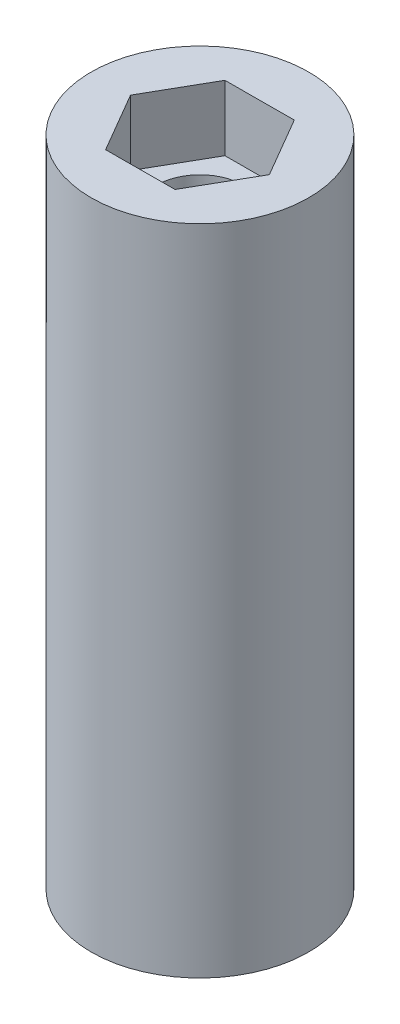
ISO-10303-21;
HEADER;
FILE_DESCRIPTION(('STEP AP214'),'2;1');
FILE_NAME('part.step','',(''),(''),'','','');
FILE_SCHEMA(('AUTOMOTIVE_DESIGN { 1 0 10303 214 1 1 1 1 }'));
ENDSEC;
DATA;
#1=APPLICATION_CONTEXT('core data for automotive mechanical design processes');
#2=APPLICATION_PROTOCOL_DEFINITION('international standard','automotive_design',2000,#1);
#3=PRODUCT_CONTEXT('',#1,'mechanical');
#4=PRODUCT('Part','Part','',(#3));
#5=PRODUCT_RELATED_PRODUCT_CATEGORY('part','',(#4));
#6=PRODUCT_DEFINITION_FORMATION('','',#4);
#7=PRODUCT_DEFINITION_CONTEXT('part definition',#1,'design');
#8=PRODUCT_DEFINITION('design','',#6,#7);
#9=PRODUCT_DEFINITION_SHAPE('','',#8);
#10=(LENGTH_UNIT() NAMED_UNIT(*) SI_UNIT(.MILLI.,.METRE.));
#11=(NAMED_UNIT(*) PLANE_ANGLE_UNIT() SI_UNIT($,.RADIAN.));
#12=(NAMED_UNIT(*) SI_UNIT($,.STERADIAN.) SOLID_ANGLE_UNIT());
#13=UNCERTAINTY_MEASURE_WITH_UNIT(LENGTH_MEASURE(1.E-05),#10,'distance_accuracy_value','');
#14=(GEOMETRIC_REPRESENTATION_CONTEXT(3) GLOBAL_UNCERTAINTY_ASSIGNED_CONTEXT((#13)) GLOBAL_UNIT_ASSIGNED_CONTEXT((#10,
#11,#12)) REPRESENTATION_CONTEXT('',''));
#15=CARTESIAN_POINT('',(0.,0.,0.));
#16=DIRECTION('',(0.,0.,1.));
#17=DIRECTION('',(1.,0.,0.));
#18=AXIS2_PLACEMENT_3D('',#15,#16,#17);
#19=CARTESIAN_POINT('',(0.,0.,0.));
#20=DIRECTION('',(0.,1.,0.));
#21=DIRECTION('',(0.,0.,1.));
#22=AXIS2_PLACEMENT_3D('',#19,#20,#21);
#23=CYLINDRICAL_SURFACE('',#22,2.);
#24=CARTESIAN_POINT('',(0.,3.,0.));
#25=DIRECTION('',(0.,1.,0.));
#26=DIRECTION('',(0.,0.,1.));
#27=AXIS2_PLACEMENT_3D('',#24,#25,#26);
#28=CIRCLE('',#27,2.);
#29=CARTESIAN_POINT('',(0.,3.,2.));
#30=VERTEX_POINT('',#29);
#31=EDGE_CURVE('E37',#30,#30,#28,.F.);
#32=ORIENTED_EDGE('',*,*,#31,.T.);
#33=EDGE_LOOP('',(#32));
#34=FACE_BOUND('',#33,.T.);
#35=CARTESIAN_POINT('',(0.,27.,0.));
#36=DIRECTION('',(0.,1.,0.));
#37=DIRECTION('',(0.,0.,1.));
#38=AXIS2_PLACEMENT_3D('',#35,#36,#37);
#39=CIRCLE('',#38,2.);
#40=CARTESIAN_POINT('',(0.,27.,2.));
#41=VERTEX_POINT('',#40);
#42=EDGE_CURVE('E217',#41,#41,#39,.F.);
#43=ORIENTED_EDGE('',*,*,#42,.F.);
#44=EDGE_LOOP('',(#43));
#45=FACE_BOUND('',#44,.T.);
#46=ADVANCED_FACE('F33',(#34,#45),#23,.F.);
#47=CARTESIAN_POINT('',(0.,30.,0.));
#48=DIRECTION('',(0.,-1.,0.));
#49=DIRECTION('',(0.,0.,-1.));
#50=AXIS2_PLACEMENT_3D('',#47,#48,#49);
#51=CYLINDRICAL_SURFACE('',#50,5.);
#52=CARTESIAN_POINT('',(0.,30.,0.));
#53=DIRECTION('',(0.,1.,0.));
#54=DIRECTION('',(0.,0.,1.));
#55=AXIS2_PLACEMENT_3D('',#52,#53,#54);
#56=CIRCLE('',#55,5.);
#57=CARTESIAN_POINT('',(0.,30.,5.));
#58=VERTEX_POINT('',#57);
#59=EDGE_CURVE('E11',#58,#58,#56,.T.);
#60=ORIENTED_EDGE('',*,*,#59,.F.);
#61=EDGE_LOOP('',(#60));
#62=FACE_BOUND('',#61,.T.);
#63=CARTESIAN_POINT('',(0.,0.,0.));
#64=DIRECTION('',(0.,1.,0.));
#65=DIRECTION('',(0.,0.,1.));
#66=AXIS2_PLACEMENT_3D('',#63,#64,#65);
#67=CIRCLE('',#66,5.);
#68=CARTESIAN_POINT('',(0.,0.,5.));
#69=VERTEX_POINT('',#68);
#70=EDGE_CURVE('E42',#69,#69,#67,.T.);
#71=ORIENTED_EDGE('',*,*,#70,.T.);
#72=EDGE_LOOP('',(#71));
#73=FACE_BOUND('',#72,.T.);
#74=ADVANCED_FACE('F35',(#62,#73),#51,.T.);
#75=CARTESIAN_POINT('',(0.,30.,0.));
#76=DIRECTION('',(0.,1.,0.));
#77=DIRECTION('',(0.,0.,1.));
#78=AXIS2_PLACEMENT_3D('',#75,#76,#77);
#79=PLANE('',#78);
#80=DIRECTION('',(0.99999151154788,0.,-0.00412029515770227));
#81=VECTOR('',#80,1.);
#82=CARTESIAN_POINT('',(-1.57636895135997,30.,2.75651850393238));
#83=LINE('',#82,#81);
#84=CARTESIAN_POINT('',(-1.57636895135997,30.,2.75651850393238));
#85=VERTEX_POINT('',#84);
#86=CARTESIAN_POINT('',(1.59903057472733,30.,2.74343480958096));
#87=VERTEX_POINT('',#86);
#88=EDGE_CURVE('E58',#85,#87,#83,.T.);
#89=ORIENTED_EDGE('',*,*,#88,.F.);
#90=DIRECTION('',(0.5035640360516,0.,0.863957904990413));
#91=VECTOR('',#90,1.);
#92=CARTESIAN_POINT('',(-3.1753995260873,30.,0.0130836943514207));
#93=LINE('',#92,#91);
#94=CARTESIAN_POINT('',(-3.1753995260873,30.,0.0130836943514207));
#95=VERTEX_POINT('',#94);
#96=EDGE_CURVE('E184',#95,#85,#93,.T.);
#97=ORIENTED_EDGE('',*,*,#96,.F.);
#98=DIRECTION('',(-0.496427475496279,0.,0.868078200148115));
#99=VECTOR('',#98,1.);
#100=CARTESIAN_POINT('',(-1.59903057472733,30.,-2.74343480958096));
#101=LINE('',#100,#99);
#102=CARTESIAN_POINT('',(-1.59903057472733,30.,-2.74343480958096));
#103=VERTEX_POINT('',#102);
#104=EDGE_CURVE('E210',#103,#95,#101,.T.);
#105=ORIENTED_EDGE('',*,*,#104,.F.);
#106=DIRECTION('',(-0.99999151154788,0.,0.00412029515770227));
#107=VECTOR('',#106,1.);
#108=CARTESIAN_POINT('',(1.57636895135997,30.,-2.75651850393238));
#109=LINE('',#108,#107);
#110=CARTESIAN_POINT('',(1.57636895135997,30.,-2.75651850393238));
#111=VERTEX_POINT('',#110);
#112=EDGE_CURVE('E207',#111,#103,#109,.T.);
#113=ORIENTED_EDGE('',*,*,#112,.F.);
#114=DIRECTION('',(-0.5035640360516,0.,-0.863957904990413));
#115=VECTOR('',#114,1.);
#116=CARTESIAN_POINT('',(3.1753995260873,30.,-0.0130836943514213));
#117=LINE('',#116,#115);
#118=CARTESIAN_POINT('',(3.1753995260873,30.,-0.0130836943514213));
#119=VERTEX_POINT('',#118);
#120=EDGE_CURVE('E204',#119,#111,#117,.T.);
#121=ORIENTED_EDGE('',*,*,#120,.F.);
#122=DIRECTION('',(0.496427475496279,0.,-0.868078200148115));
#123=VECTOR('',#122,1.);
#124=CARTESIAN_POINT('',(1.59903057472733,30.,2.74343480958096));
#125=LINE('',#124,#123);
#126=EDGE_CURVE('E201',#87,#119,#125,.T.);
#127=ORIENTED_EDGE('',*,*,#126,.F.);
#128=EDGE_LOOP('',(#89,#97,#105,#113,#121,#127));
#129=FACE_BOUND('',#128,.T.);
#130=ORIENTED_EDGE('',*,*,#59,.T.);
#131=EDGE_LOOP('',(#130));
#132=FACE_BOUND('',#131,.T.);
#133=ADVANCED_FACE('F239',(#129,#132),#79,.T.);
#134=CARTESIAN_POINT('',(0.,0.,0.));
#135=DIRECTION('',(0.,1.,0.));
#136=DIRECTION('',(0.,0.,1.));
#137=AXIS2_PLACEMENT_3D('',#134,#135,#136);
#138=PLANE('',#137);
#139=DIRECTION('',(0.5035640360516,0.,0.863957904990413));
#140=VECTOR('',#139,1.);
#141=CARTESIAN_POINT('',(-3.1753995260873,0.,0.0130836943514207));
#142=LINE('',#141,#140);
#143=CARTESIAN_POINT('',(-3.1753995260873,0.,0.0130836943514207));
#144=VERTEX_POINT('',#143);
#145=CARTESIAN_POINT('',(-1.57636895135997,0.,2.75651850393238));
#146=VERTEX_POINT('',#145);
#147=EDGE_CURVE('E136',#144,#146,#142,.T.);
#148=ORIENTED_EDGE('',*,*,#147,.T.);
#149=DIRECTION('',(0.99999151154788,0.,-0.00412029515770227));
#150=VECTOR('',#149,1.);
#151=CARTESIAN_POINT('',(-1.57636895135997,0.,2.75651850393238));
#152=LINE('',#151,#150);
#153=CARTESIAN_POINT('',(1.59903057472733,0.,2.74343480958096));
#154=VERTEX_POINT('',#153);
#155=EDGE_CURVE('E128',#146,#154,#152,.T.);
#156=ORIENTED_EDGE('',*,*,#155,.T.);
#157=DIRECTION('',(0.496427475496279,0.,-0.868078200148115));
#158=VECTOR('',#157,1.);
#159=CARTESIAN_POINT('',(1.59903057472733,0.,2.74343480958096));
#160=LINE('',#159,#158);
#161=CARTESIAN_POINT('',(3.1753995260873,0.,-0.0130836943514213));
#162=VERTEX_POINT('',#161);
#163=EDGE_CURVE('E139',#154,#162,#160,.T.);
#164=ORIENTED_EDGE('',*,*,#163,.T.);
#165=DIRECTION('',(-0.5035640360516,0.,-0.863957904990413));
#166=VECTOR('',#165,1.);
#167=CARTESIAN_POINT('',(3.1753995260873,0.,-0.0130836943514213));
#168=LINE('',#167,#166);
#169=CARTESIAN_POINT('',(1.57636895135997,0.,-2.75651850393238));
#170=VERTEX_POINT('',#169);
#171=EDGE_CURVE('E50',#162,#170,#168,.T.);
#172=ORIENTED_EDGE('',*,*,#171,.T.);
#173=DIRECTION('',(-0.99999151154788,0.,0.00412029515770227));
#174=VECTOR('',#173,1.);
#175=CARTESIAN_POINT('',(1.57636895135997,0.,-2.75651850393238));
#176=LINE('',#175,#174);
#177=CARTESIAN_POINT('',(-1.59903057472733,0.,-2.74343480958096));
#178=VERTEX_POINT('',#177);
#179=EDGE_CURVE('E154',#170,#178,#176,.T.);
#180=ORIENTED_EDGE('',*,*,#179,.T.);
#181=DIRECTION('',(-0.496427475496279,0.,0.868078200148115));
#182=VECTOR('',#181,1.);
#183=CARTESIAN_POINT('',(-1.59903057472733,0.,-2.74343480958096));
#184=LINE('',#183,#182);
#185=EDGE_CURVE('E157',#178,#144,#184,.T.);
#186=ORIENTED_EDGE('',*,*,#185,.T.);
#187=EDGE_LOOP('',(#148,#156,#164,#172,#180,#186));
#188=FACE_BOUND('',#187,.T.);
#189=ORIENTED_EDGE('',*,*,#70,.F.);
#190=EDGE_LOOP('',(#189));
#191=FACE_BOUND('',#190,.T.);
#192=ADVANCED_FACE('F143',(#188,#191),#138,.F.);
#193=CARTESIAN_POINT('',(0.,27.,0.));
#194=DIRECTION('',(0.,1.,0.));
#195=DIRECTION('',(0.,0.,1.));
#196=AXIS2_PLACEMENT_3D('',#193,#194,#195);
#197=PLANE('',#196);
#198=DIRECTION('',(0.99999151154788,0.,-0.00412029515770227));
#199=VECTOR('',#198,1.);
#200=CARTESIAN_POINT('',(-1.57636895135997,27.,2.75651850393238));
#201=LINE('',#200,#199);
#202=CARTESIAN_POINT('',(-1.57636895135997,27.,2.75651850393238));
#203=VERTEX_POINT('',#202);
#204=CARTESIAN_POINT('',(1.59903057472733,27.,2.74343480958096));
#205=VERTEX_POINT('',#204);
#206=EDGE_CURVE('E180',#203,#205,#201,.T.);
#207=ORIENTED_EDGE('',*,*,#206,.T.);
#208=DIRECTION('',(0.496427475496279,0.,-0.868078200148115));
#209=VECTOR('',#208,1.);
#210=CARTESIAN_POINT('',(1.59903057472733,27.,2.74343480958096));
#211=LINE('',#210,#209);
#212=CARTESIAN_POINT('',(3.1753995260873,27.,-0.0130836943514213));
#213=VERTEX_POINT('',#212);
#214=EDGE_CURVE('E183',#205,#213,#211,.T.);
#215=ORIENTED_EDGE('',*,*,#214,.T.);
#216=DIRECTION('',(-0.5035640360516,0.,-0.863957904990413));
#217=VECTOR('',#216,1.);
#218=CARTESIAN_POINT('',(3.1753995260873,27.,-0.0130836943514213));
#219=LINE('',#218,#217);
#220=CARTESIAN_POINT('',(1.57636895135997,27.,-2.75651850393238));
#221=VERTEX_POINT('',#220);
#222=EDGE_CURVE('E187',#213,#221,#219,.T.);
#223=ORIENTED_EDGE('',*,*,#222,.T.);
#224=DIRECTION('',(-0.99999151154788,0.,0.00412029515770227));
#225=VECTOR('',#224,1.);
#226=CARTESIAN_POINT('',(1.57636895135997,27.,-2.75651850393238));
#227=LINE('',#226,#225);
#228=CARTESIAN_POINT('',(-1.59903057472733,27.,-2.74343480958096));
#229=VERTEX_POINT('',#228);
#230=EDGE_CURVE('E190',#221,#229,#227,.T.);
#231=ORIENTED_EDGE('',*,*,#230,.T.);
#232=DIRECTION('',(-0.496427475496279,0.,0.868078200148115));
#233=VECTOR('',#232,1.);
#234=CARTESIAN_POINT('',(-1.59903057472733,27.,-2.74343480958096));
#235=LINE('',#234,#233);
#236=CARTESIAN_POINT('',(-3.1753995260873,27.,0.0130836943514207));
#237=VERTEX_POINT('',#236);
#238=EDGE_CURVE('E193',#229,#237,#235,.T.);
#239=ORIENTED_EDGE('',*,*,#238,.T.);
#240=DIRECTION('',(0.5035640360516,0.,0.863957904990413));
#241=VECTOR('',#240,1.);
#242=CARTESIAN_POINT('',(-3.1753995260873,27.,0.0130836943514207));
#243=LINE('',#242,#241);
#244=EDGE_CURVE('E196',#237,#203,#243,.T.);
#245=ORIENTED_EDGE('',*,*,#244,.T.);
#246=EDGE_LOOP('',(#207,#215,#223,#231,#239,#245));
#247=FACE_BOUND('',#246,.T.);
#248=ORIENTED_EDGE('',*,*,#42,.T.);
#249=EDGE_LOOP('',(#248));
#250=FACE_BOUND('',#249,.T.);
#251=ADVANCED_FACE('F231',(#247,#250),#197,.T.);
#252=CARTESIAN_POINT('',(-1.57636895135997,27.,2.75651850393238));
#253=DIRECTION('',(0.00412029515770227,0.,0.99999151154788));
#254=DIRECTION('',(0.99999151154788,0.,-0.00412029515770227));
#255=AXIS2_PLACEMENT_3D('',#252,#253,#254);
#256=PLANE('',#255);
#257=ORIENTED_EDGE('',*,*,#88,.T.);
#258=DIRECTION('',(0.,1.,0.));
#259=VECTOR('',#258,1.);
#260=CARTESIAN_POINT('',(1.59903057472733,27.,2.74343480958096));
#261=LINE('',#260,#259);
#262=EDGE_CURVE('E199',#205,#87,#261,.T.);
#263=ORIENTED_EDGE('',*,*,#262,.F.);
#264=ORIENTED_EDGE('',*,*,#206,.F.);
#265=DIRECTION('',(0.,1.,0.));
#266=VECTOR('',#265,1.);
#267=CARTESIAN_POINT('',(-1.57636895135997,27.,2.75651850393238));
#268=LINE('',#267,#266);
#269=EDGE_CURVE('E215',#203,#85,#268,.T.);
#270=ORIENTED_EDGE('',*,*,#269,.T.);
#271=EDGE_LOOP('',(#257,#263,#264,#270));
#272=FACE_BOUND('',#271,.T.);
#273=ADVANCED_FACE('F244',(#272),#256,.F.);
#274=CARTESIAN_POINT('',(-3.1753995260873,27.,0.0130836943514207));
#275=DIRECTION('',(-0.863957904990413,0.,0.5035640360516));
#276=DIRECTION('',(0.5035640360516,0.,0.863957904990413));
#277=AXIS2_PLACEMENT_3D('',#274,#275,#276);
#278=PLANE('',#277);
#279=ORIENTED_EDGE('',*,*,#96,.T.);
#280=ORIENTED_EDGE('',*,*,#269,.F.);
#281=ORIENTED_EDGE('',*,*,#244,.F.);
#282=DIRECTION('',(0.,1.,0.));
#283=VECTOR('',#282,1.);
#284=CARTESIAN_POINT('',(-3.1753995260873,27.,0.0130836943514207));
#285=LINE('',#284,#283);
#286=EDGE_CURVE('E218',#237,#95,#285,.T.);
#287=ORIENTED_EDGE('',*,*,#286,.T.);
#288=EDGE_LOOP('',(#279,#280,#281,#287));
#289=FACE_BOUND('',#288,.T.);
#290=ADVANCED_FACE('F257',(#289),#278,.F.);
#291=CARTESIAN_POINT('',(-1.59903057472733,27.,-2.74343480958096));
#292=DIRECTION('',(-0.868078200148115,0.,-0.496427475496279));
#293=DIRECTION('',(-0.496427475496279,0.,0.868078200148115));
#294=AXIS2_PLACEMENT_3D('',#291,#292,#293);
#295=PLANE('',#294);
#296=ORIENTED_EDGE('',*,*,#104,.T.);
#297=ORIENTED_EDGE('',*,*,#286,.F.);
#298=ORIENTED_EDGE('',*,*,#238,.F.);
#299=DIRECTION('',(0.,1.,0.));
#300=VECTOR('',#299,1.);
#301=CARTESIAN_POINT('',(-1.59903057472733,27.,-2.74343480958096));
#302=LINE('',#301,#300);
#303=EDGE_CURVE('E220',#229,#103,#302,.T.);
#304=ORIENTED_EDGE('',*,*,#303,.T.);
#305=EDGE_LOOP('',(#296,#297,#298,#304));
#306=FACE_BOUND('',#305,.T.);
#307=ADVANCED_FACE('F263',(#306),#295,.F.);
#308=CARTESIAN_POINT('',(1.57636895135997,27.,-2.75651850393238));
#309=DIRECTION('',(-0.00412029515770227,0.,-0.99999151154788));
#310=DIRECTION('',(-0.99999151154788,0.,0.00412029515770227));
#311=AXIS2_PLACEMENT_3D('',#308,#309,#310);
#312=PLANE('',#311);
#313=ORIENTED_EDGE('',*,*,#112,.T.);
#314=ORIENTED_EDGE('',*,*,#303,.F.);
#315=ORIENTED_EDGE('',*,*,#230,.F.);
#316=DIRECTION('',(0.,1.,0.));
#317=VECTOR('',#316,1.);
#318=CARTESIAN_POINT('',(1.57636895135997,27.,-2.75651850393238));
#319=LINE('',#318,#317);
#320=EDGE_CURVE('E222',#221,#111,#319,.T.);
#321=ORIENTED_EDGE('',*,*,#320,.T.);
#322=EDGE_LOOP('',(#313,#314,#315,#321));
#323=FACE_BOUND('',#322,.T.);
#324=ADVANCED_FACE('F267',(#323),#312,.F.);
#325=CARTESIAN_POINT('',(3.1753995260873,27.,-0.0130836943514213));
#326=DIRECTION('',(0.863957904990413,0.,-0.5035640360516));
#327=DIRECTION('',(-0.5035640360516,0.,-0.863957904990413));
#328=AXIS2_PLACEMENT_3D('',#325,#326,#327);
#329=PLANE('',#328);
#330=ORIENTED_EDGE('',*,*,#120,.T.);
#331=ORIENTED_EDGE('',*,*,#320,.F.);
#332=ORIENTED_EDGE('',*,*,#222,.F.);
#333=DIRECTION('',(0.,1.,0.));
#334=VECTOR('',#333,1.);
#335=CARTESIAN_POINT('',(3.1753995260873,27.,-0.0130836943514213));
#336=LINE('',#335,#334);
#337=EDGE_CURVE('E224',#213,#119,#336,.T.);
#338=ORIENTED_EDGE('',*,*,#337,.T.);
#339=EDGE_LOOP('',(#330,#331,#332,#338));
#340=FACE_BOUND('',#339,.T.);
#341=ADVANCED_FACE('F271',(#340),#329,.F.);
#342=CARTESIAN_POINT('',(1.59903057472733,27.,2.74343480958096));
#343=DIRECTION('',(0.868078200148115,0.,0.496427475496279));
#344=DIRECTION('',(0.496427475496279,0.,-0.868078200148115));
#345=AXIS2_PLACEMENT_3D('',#342,#343,#344);
#346=PLANE('',#345);
#347=ORIENTED_EDGE('',*,*,#126,.T.);
#348=ORIENTED_EDGE('',*,*,#337,.F.);
#349=ORIENTED_EDGE('',*,*,#214,.F.);
#350=ORIENTED_EDGE('',*,*,#262,.T.);
#351=EDGE_LOOP('',(#347,#348,#349,#350));
#352=FACE_BOUND('',#351,.T.);
#353=ADVANCED_FACE('F274',(#352),#346,.F.);
#354=CARTESIAN_POINT('',(0.,3.,0.));
#355=DIRECTION('',(0.,1.,0.));
#356=DIRECTION('',(0.,0.,1.));
#357=AXIS2_PLACEMENT_3D('',#354,#355,#356);
#358=PLANE('',#357);
#359=DIRECTION('',(0.99999151154788,0.,-0.00412029515770227));
#360=VECTOR('',#359,1.);
#361=CARTESIAN_POINT('',(-1.57636895135997,3.,2.75651850393238));
#362=LINE('',#361,#360);
#363=CARTESIAN_POINT('',(-1.57636895135997,3.,2.75651850393238));
#364=VERTEX_POINT('',#363);
#365=CARTESIAN_POINT('',(1.59903057472733,3.,2.74343480958096));
#366=VERTEX_POINT('',#365);
#367=EDGE_CURVE('E131',#364,#366,#362,.T.);
#368=ORIENTED_EDGE('',*,*,#367,.F.);
#369=DIRECTION('',(0.5035640360516,0.,0.863957904990413));
#370=VECTOR('',#369,1.);
#371=CARTESIAN_POINT('',(-3.1753995260873,3.,0.0130836943514207));
#372=LINE('',#371,#370);
#373=CARTESIAN_POINT('',(-3.1753995260873,3.,0.0130836943514207));
#374=VERTEX_POINT('',#373);
#375=EDGE_CURVE('E147',#374,#364,#372,.T.);
#376=ORIENTED_EDGE('',*,*,#375,.F.);
#377=DIRECTION('',(-0.496427475496279,0.,0.868078200148115));
#378=VECTOR('',#377,1.);
#379=CARTESIAN_POINT('',(-1.59903057472733,3.,-2.74343480958096));
#380=LINE('',#379,#378);
#381=CARTESIAN_POINT('',(-1.59903057472733,3.,-2.74343480958096));
#382=VERTEX_POINT('',#381);
#383=EDGE_CURVE('E150',#382,#374,#380,.T.);
#384=ORIENTED_EDGE('',*,*,#383,.F.);
#385=DIRECTION('',(-0.99999151154788,0.,0.00412029515770227));
#386=VECTOR('',#385,1.);
#387=CARTESIAN_POINT('',(1.57636895135997,3.,-2.75651850393238));
#388=LINE('',#387,#386);
#389=CARTESIAN_POINT('',(1.57636895135997,3.,-2.75651850393238));
#390=VERTEX_POINT('',#389);
#391=EDGE_CURVE('E166',#390,#382,#388,.T.);
#392=ORIENTED_EDGE('',*,*,#391,.F.);
#393=DIRECTION('',(-0.5035640360516,0.,-0.863957904990413));
#394=VECTOR('',#393,1.);
#395=CARTESIAN_POINT('',(3.1753995260873,3.,-0.0130836943514213));
#396=LINE('',#395,#394);
#397=CARTESIAN_POINT('',(3.1753995260873,3.,-0.0130836943514213));
#398=VERTEX_POINT('',#397);
#399=EDGE_CURVE('E163',#398,#390,#396,.T.);
#400=ORIENTED_EDGE('',*,*,#399,.F.);
#401=DIRECTION('',(0.496427475496279,0.,-0.868078200148115));
#402=VECTOR('',#401,1.);
#403=CARTESIAN_POINT('',(1.59903057472733,3.,2.74343480958096));
#404=LINE('',#403,#402);
#405=EDGE_CURVE('E161',#366,#398,#404,.T.);
#406=ORIENTED_EDGE('',*,*,#405,.F.);
#407=EDGE_LOOP('',(#368,#376,#384,#392,#400,#406));
#408=FACE_BOUND('',#407,.T.);
#409=ORIENTED_EDGE('',*,*,#31,.F.);
#410=EDGE_LOOP('',(#409));
#411=FACE_BOUND('',#410,.T.);
#412=ADVANCED_FACE('F277',(#408,#411),#358,.F.);
#413=CARTESIAN_POINT('',(-1.57636895135997,0.,2.75651850393238));
#414=DIRECTION('',(0.00412029515770227,0.,0.99999151154788));
#415=DIRECTION('',(0.99999151154788,0.,-0.00412029515770227));
#416=AXIS2_PLACEMENT_3D('',#413,#414,#415);
#417=PLANE('',#416);
#418=ORIENTED_EDGE('',*,*,#367,.T.);
#419=DIRECTION('',(0.,1.,0.));
#420=VECTOR('',#419,1.);
#421=CARTESIAN_POINT('',(1.59903057472733,0.,2.74343480958096));
#422=LINE('',#421,#420);
#423=EDGE_CURVE('E124',#154,#366,#422,.T.);
#424=ORIENTED_EDGE('',*,*,#423,.F.);
#425=ORIENTED_EDGE('',*,*,#155,.F.);
#426=DIRECTION('',(0.,1.,0.));
#427=VECTOR('',#426,1.);
#428=CARTESIAN_POINT('',(-1.57636895135997,0.,2.75651850393238));
#429=LINE('',#428,#427);
#430=EDGE_CURVE('E171',#146,#364,#429,.T.);
#431=ORIENTED_EDGE('',*,*,#430,.T.);
#432=EDGE_LOOP('',(#418,#424,#425,#431));
#433=FACE_BOUND('',#432,.T.);
#434=ADVANCED_FACE('F126',(#433),#417,.F.);
#435=CARTESIAN_POINT('',(-3.1753995260873,0.,0.0130836943514207));
#436=DIRECTION('',(-0.863957904990413,0.,0.5035640360516));
#437=DIRECTION('',(0.5035640360516,0.,0.863957904990413));
#438=AXIS2_PLACEMENT_3D('',#435,#436,#437);
#439=PLANE('',#438);
#440=ORIENTED_EDGE('',*,*,#375,.T.);
#441=ORIENTED_EDGE('',*,*,#430,.F.);
#442=ORIENTED_EDGE('',*,*,#147,.F.);
#443=DIRECTION('',(0.,1.,0.));
#444=VECTOR('',#443,1.);
#445=CARTESIAN_POINT('',(-3.1753995260873,0.,0.0130836943514207));
#446=LINE('',#445,#444);
#447=EDGE_CURVE('E173',#144,#374,#446,.T.);
#448=ORIENTED_EDGE('',*,*,#447,.T.);
#449=EDGE_LOOP('',(#440,#441,#442,#448));
#450=FACE_BOUND('',#449,.T.);
#451=ADVANCED_FACE('F302',(#450),#439,.F.);
#452=CARTESIAN_POINT('',(-1.59903057472733,0.,-2.74343480958096));
#453=DIRECTION('',(-0.868078200148115,0.,-0.496427475496279));
#454=DIRECTION('',(-0.496427475496279,0.,0.868078200148115));
#455=AXIS2_PLACEMENT_3D('',#452,#453,#454);
#456=PLANE('',#455);
#457=ORIENTED_EDGE('',*,*,#383,.T.);
#458=ORIENTED_EDGE('',*,*,#447,.F.);
#459=ORIENTED_EDGE('',*,*,#185,.F.);
#460=DIRECTION('',(0.,1.,0.));
#461=VECTOR('',#460,1.);
#462=CARTESIAN_POINT('',(-1.59903057472733,0.,-2.74343480958096));
#463=LINE('',#462,#461);
#464=EDGE_CURVE('E175',#178,#382,#463,.T.);
#465=ORIENTED_EDGE('',*,*,#464,.T.);
#466=EDGE_LOOP('',(#457,#458,#459,#465));
#467=FACE_BOUND('',#466,.T.);
#468=ADVANCED_FACE('F307',(#467),#456,.F.);
#469=CARTESIAN_POINT('',(1.57636895135997,0.,-2.75651850393238));
#470=DIRECTION('',(-0.00412029515770227,0.,-0.99999151154788));
#471=DIRECTION('',(-0.99999151154788,0.,0.00412029515770227));
#472=AXIS2_PLACEMENT_3D('',#469,#470,#471);
#473=PLANE('',#472);
#474=ORIENTED_EDGE('',*,*,#391,.T.);
#475=ORIENTED_EDGE('',*,*,#464,.F.);
#476=ORIENTED_EDGE('',*,*,#179,.F.);
#477=DIRECTION('',(0.,1.,0.));
#478=VECTOR('',#477,1.);
#479=CARTESIAN_POINT('',(1.57636895135997,0.,-2.75651850393238));
#480=LINE('',#479,#478);
#481=EDGE_CURVE('E177',#170,#390,#480,.T.);
#482=ORIENTED_EDGE('',*,*,#481,.T.);
#483=EDGE_LOOP('',(#474,#475,#476,#482));
#484=FACE_BOUND('',#483,.T.);
#485=ADVANCED_FACE('F311',(#484),#473,.F.);
#486=CARTESIAN_POINT('',(3.1753995260873,0.,-0.0130836943514213));
#487=DIRECTION('',(0.863957904990413,0.,-0.5035640360516));
#488=DIRECTION('',(-0.5035640360516,0.,-0.863957904990413));
#489=AXIS2_PLACEMENT_3D('',#486,#487,#488);
#490=PLANE('',#489);
#491=ORIENTED_EDGE('',*,*,#399,.T.);
#492=ORIENTED_EDGE('',*,*,#481,.F.);
#493=ORIENTED_EDGE('',*,*,#171,.F.);
#494=DIRECTION('',(0.,1.,0.));
#495=VECTOR('',#494,1.);
#496=CARTESIAN_POINT('',(3.1753995260873,0.,-0.0130836943514213));
#497=LINE('',#496,#495);
#498=EDGE_CURVE('E135',#162,#398,#497,.T.);
#499=ORIENTED_EDGE('',*,*,#498,.T.);
#500=EDGE_LOOP('',(#491,#492,#493,#499));
#501=FACE_BOUND('',#500,.T.);
#502=ADVANCED_FACE('F315',(#501),#490,.F.);
#503=CARTESIAN_POINT('',(1.59903057472733,0.,2.74343480958096));
#504=DIRECTION('',(0.868078200148115,0.,0.496427475496279));
#505=DIRECTION('',(0.496427475496279,0.,-0.868078200148115));
#506=AXIS2_PLACEMENT_3D('',#503,#504,#505);
#507=PLANE('',#506);
#508=ORIENTED_EDGE('',*,*,#405,.T.);
#509=ORIENTED_EDGE('',*,*,#498,.F.);
#510=ORIENTED_EDGE('',*,*,#163,.F.);
#511=ORIENTED_EDGE('',*,*,#423,.T.);
#512=EDGE_LOOP('',(#508,#509,#510,#511));
#513=FACE_BOUND('',#512,.T.);
#514=ADVANCED_FACE('F140',(#513),#507,.F.);
#515=CLOSED_SHELL('',(#46,#74,#133,#192,#251,#273,#290,#307,#324,#341,#353,#412,#434,#451,#468,
#485,#502,#514));
#516=MANIFOLD_SOLID_BREP('B2',#515);
#517=ADVANCED_BREP_SHAPE_REPRESENTATION('',(#18,#516),#14);
#518=SHAPE_DEFINITION_REPRESENTATION(#9,#517);
ENDSEC;
END-ISO-10303-21;
